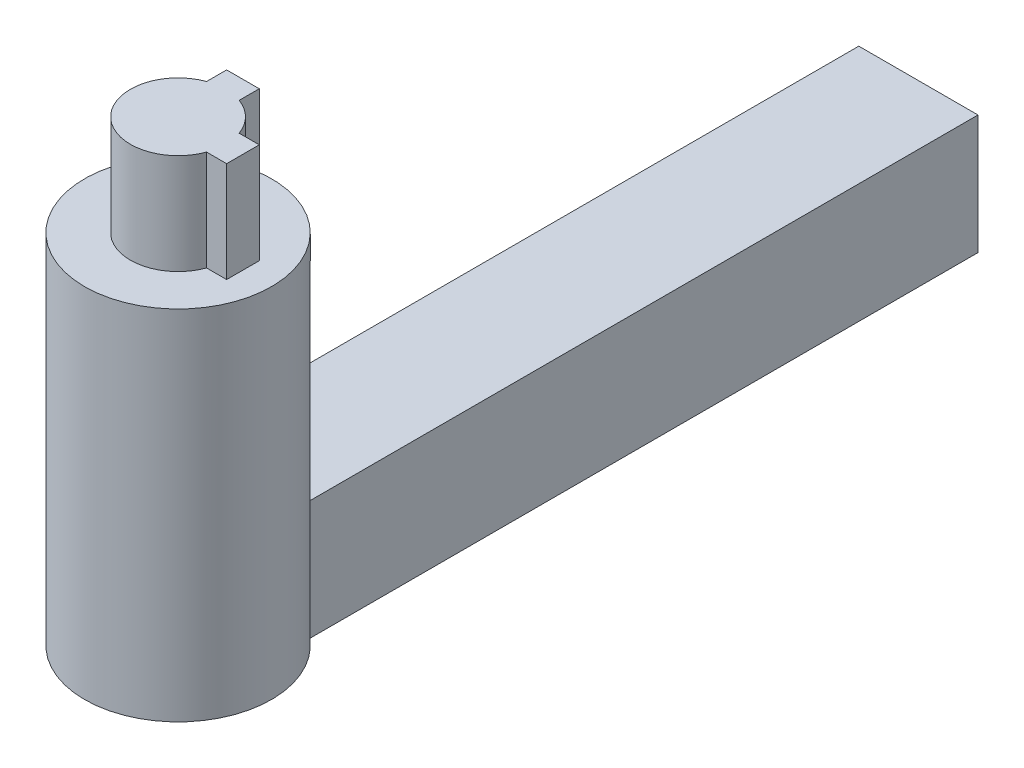
ISO-10303-21;
HEADER;
FILE_DESCRIPTION(('STEP AP214'),'2;1');
FILE_NAME('part.step','',(''),(''),'','','');
FILE_SCHEMA(('AUTOMOTIVE_DESIGN { 1 0 10303 214 1 1 1 1 }'));
ENDSEC;
DATA;
#1=APPLICATION_CONTEXT('core data for automotive mechanical design processes');
#2=APPLICATION_PROTOCOL_DEFINITION('international standard','automotive_design',2000,#1);
#3=PRODUCT_CONTEXT('',#1,'mechanical');
#4=PRODUCT('Part','Part','',(#3));
#5=PRODUCT_RELATED_PRODUCT_CATEGORY('part','',(#4));
#6=PRODUCT_DEFINITION_FORMATION('','',#4);
#7=PRODUCT_DEFINITION_CONTEXT('part definition',#1,'design');
#8=PRODUCT_DEFINITION('design','',#6,#7);
#9=PRODUCT_DEFINITION_SHAPE('','',#8);
#10=(LENGTH_UNIT() NAMED_UNIT(*) SI_UNIT(.MILLI.,.METRE.));
#11=(NAMED_UNIT(*) PLANE_ANGLE_UNIT() SI_UNIT($,.RADIAN.));
#12=(NAMED_UNIT(*) SI_UNIT($,.STERADIAN.) SOLID_ANGLE_UNIT());
#13=UNCERTAINTY_MEASURE_WITH_UNIT(LENGTH_MEASURE(1.E-05),#10,'distance_accuracy_value','');
#14=(GEOMETRIC_REPRESENTATION_CONTEXT(3) GLOBAL_UNCERTAINTY_ASSIGNED_CONTEXT((#13)) GLOBAL_UNIT_ASSIGNED_CONTEXT((#10,
#11,#12)) REPRESENTATION_CONTEXT('',''));
#15=CARTESIAN_POINT('',(0.,0.,0.));
#16=DIRECTION('',(0.,0.,1.));
#17=DIRECTION('',(1.,0.,0.));
#18=AXIS2_PLACEMENT_3D('',#15,#16,#17);
#19=CARTESIAN_POINT('',(4.75,9.5,-29.5));
#20=DIRECTION('',(-1.,0.,0.));
#21=DIRECTION('',(0.,0.,1.));
#22=AXIS2_PLACEMENT_3D('',#19,#20,#21);
#23=PLANE('',#22);
#24=DIRECTION('',(0.,0.,-1.));
#25=VECTOR('',#24,1.);
#26=CARTESIAN_POINT('',(4.75,9.5,-29.5));
#27=LINE('',#26,#25);
#28=CARTESIAN_POINT('',(4.75,9.5,23.7606620590873));
#29=VERTEX_POINT('',#28);
#30=CARTESIAN_POINT('',(4.75,9.5,-29.5));
#31=VERTEX_POINT('',#30);
#32=EDGE_CURVE('E181',#29,#31,#27,.T.);
#33=ORIENTED_EDGE('',*,*,#32,.F.);
#34=DIRECTION('',(0.,1.,0.));
#35=VECTOR('',#34,1.);
#36=CARTESIAN_POINT('',(4.75,-21.0717820793591,23.7606620590873));
#37=LINE('',#36,#35);
#38=CARTESIAN_POINT('',(4.75,0.,23.7606620590873));
#39=VERTEX_POINT('',#38);
#40=EDGE_CURVE('E177',#29,#39,#37,.F.);
#41=ORIENTED_EDGE('',*,*,#40,.T.);
#42=DIRECTION('',(0.,0.,-1.));
#43=VECTOR('',#42,1.);
#44=CARTESIAN_POINT('',(4.75,0.,-29.5));
#45=LINE('',#44,#43);
#46=CARTESIAN_POINT('',(4.75,0.,-29.5));
#47=VERTEX_POINT('',#46);
#48=EDGE_CURVE('E180',#39,#47,#45,.T.);
#49=ORIENTED_EDGE('',*,*,#48,.T.);
#50=DIRECTION('',(0.,-1.,0.));
#51=VECTOR('',#50,1.);
#52=CARTESIAN_POINT('',(4.75,9.5,-29.5));
#53=LINE('',#52,#51);
#54=EDGE_CURVE('E11',#31,#47,#53,.T.);
#55=ORIENTED_EDGE('',*,*,#54,.F.);
#56=EDGE_LOOP('',(#33,#41,#49,#55));
#57=FACE_BOUND('',#56,.T.);
#58=ADVANCED_FACE('F43',(#57),#23,.F.);
#59=CARTESIAN_POINT('',(-4.75,9.5,-29.5));
#60=DIRECTION('',(0.,0.,1.));
#61=DIRECTION('',(1.,0.,0.));
#62=AXIS2_PLACEMENT_3D('',#59,#60,#61);
#63=PLANE('',#62);
#64=DIRECTION('',(-1.,0.,0.));
#65=VECTOR('',#64,1.);
#66=CARTESIAN_POINT('',(-4.75,0.,-29.5));
#67=LINE('',#66,#65);
#68=CARTESIAN_POINT('',(-4.75,0.,-29.5));
#69=VERTEX_POINT('',#68);
#70=EDGE_CURVE('E193',#47,#69,#67,.T.);
#71=ORIENTED_EDGE('',*,*,#70,.T.);
#72=DIRECTION('',(0.,-1.,0.));
#73=VECTOR('',#72,1.);
#74=CARTESIAN_POINT('',(-4.75,9.5,-29.5));
#75=LINE('',#74,#73);
#76=CARTESIAN_POINT('',(-4.75,9.5,-29.5));
#77=VERTEX_POINT('',#76);
#78=EDGE_CURVE('E51',#77,#69,#75,.T.);
#79=ORIENTED_EDGE('',*,*,#78,.F.);
#80=DIRECTION('',(-1.,0.,0.));
#81=VECTOR('',#80,1.);
#82=CARTESIAN_POINT('',(-4.75,9.5,-29.5));
#83=LINE('',#82,#81);
#84=EDGE_CURVE('E184',#31,#77,#83,.T.);
#85=ORIENTED_EDGE('',*,*,#84,.F.);
#86=ORIENTED_EDGE('',*,*,#54,.T.);
#87=EDGE_LOOP('',(#71,#79,#85,#86));
#88=FACE_BOUND('',#87,.T.);
#89=ADVANCED_FACE('F220',(#88),#63,.F.);
#90=CARTESIAN_POINT('',(-4.75,9.5,-29.5));
#91=DIRECTION('',(1.,0.,0.));
#92=DIRECTION('',(0.,0.,-1.));
#93=AXIS2_PLACEMENT_3D('',#90,#91,#92);
#94=PLANE('',#93);
#95=DIRECTION('',(0.,0.,1.));
#96=VECTOR('',#95,1.);
#97=CARTESIAN_POINT('',(-4.75,0.,-29.5));
#98=LINE('',#97,#96);
#99=CARTESIAN_POINT('',(-4.75,0.,23.7606620590873));
#100=VERTEX_POINT('',#99);
#101=EDGE_CURVE('E185',#69,#100,#98,.T.);
#102=ORIENTED_EDGE('',*,*,#101,.T.);
#103=DIRECTION('',(0.,1.,0.));
#104=VECTOR('',#103,1.);
#105=CARTESIAN_POINT('',(-4.75,-21.0717820793591,23.7606620590873));
#106=LINE('',#105,#104);
#107=CARTESIAN_POINT('',(-4.75,9.5,23.7606620590873));
#108=VERTEX_POINT('',#107);
#109=EDGE_CURVE('E173',#100,#108,#106,.T.);
#110=ORIENTED_EDGE('',*,*,#109,.T.);
#111=DIRECTION('',(0.,0.,1.));
#112=VECTOR('',#111,1.);
#113=CARTESIAN_POINT('',(-4.75,9.5,-29.5));
#114=LINE('',#113,#112);
#115=EDGE_CURVE('E188',#77,#108,#114,.T.);
#116=ORIENTED_EDGE('',*,*,#115,.F.);
#117=ORIENTED_EDGE('',*,*,#78,.T.);
#118=EDGE_LOOP('',(#102,#110,#116,#117));
#119=FACE_BOUND('',#118,.T.);
#120=ADVANCED_FACE('F203',(#119),#94,.F.);
#121=CARTESIAN_POINT('',(0.,9.5,0.));
#122=DIRECTION('',(0.,1.,0.));
#123=DIRECTION('',(0.,0.,1.));
#124=AXIS2_PLACEMENT_3D('',#121,#122,#123);
#125=PLANE('',#124);
#126=CARTESIAN_POINT('',(0.,9.5,29.5));
#127=DIRECTION('',(0.,1.,0.));
#128=DIRECTION('',(0.,0.,1.));
#129=AXIS2_PLACEMENT_3D('',#126,#127,#128);
#130=CIRCLE('',#129,7.45);
#131=EDGE_CURVE('E169',#29,#108,#130,.T.);
#132=ORIENTED_EDGE('',*,*,#131,.F.);
#133=ORIENTED_EDGE('',*,*,#32,.T.);
#134=ORIENTED_EDGE('',*,*,#84,.T.);
#135=ORIENTED_EDGE('',*,*,#115,.T.);
#136=EDGE_LOOP('',(#132,#133,#134,#135));
#137=FACE_BOUND('',#136,.T.);
#138=ADVANCED_FACE('F217',(#137),#125,.T.);
#139=CARTESIAN_POINT('',(0.,0.,0.));
#140=DIRECTION('',(0.,1.,0.));
#141=DIRECTION('',(0.,0.,1.));
#142=AXIS2_PLACEMENT_3D('',#139,#140,#141);
#143=PLANE('',#142);
#144=ORIENTED_EDGE('',*,*,#48,.F.);
#145=CARTESIAN_POINT('',(0.,0.,29.5));
#146=DIRECTION('',(0.,1.,0.));
#147=DIRECTION('',(0.,0.,1.));
#148=AXIS2_PLACEMENT_3D('',#145,#146,#147);
#149=CIRCLE('',#148,7.45);
#150=EDGE_CURVE('E160',#39,#100,#149,.F.);
#151=ORIENTED_EDGE('',*,*,#150,.T.);
#152=ORIENTED_EDGE('',*,*,#101,.F.);
#153=ORIENTED_EDGE('',*,*,#70,.F.);
#154=EDGE_LOOP('',(#144,#151,#152,#153));
#155=FACE_BOUND('',#154,.T.);
#156=ADVANCED_FACE('F210',(#155),#143,.F.);
#157=CARTESIAN_POINT('',(0.,-21.0717820793591,29.5));
#158=DIRECTION('',(0.,1.,0.));
#159=DIRECTION('',(0.,0.,1.));
#160=AXIS2_PLACEMENT_3D('',#157,#158,#159);
#161=CYLINDRICAL_SURFACE('',#160,7.45);
#162=CARTESIAN_POINT('',(0.,28.5,29.5));
#163=DIRECTION('',(0.,1.,0.));
#164=DIRECTION('',(0.,0.,1.));
#165=AXIS2_PLACEMENT_3D('',#162,#163,#164);
#166=CIRCLE('',#165,7.45);
#167=CARTESIAN_POINT('',(0.,28.5,36.95));
#168=VERTEX_POINT('',#167);
#169=EDGE_CURVE('E155',#168,#168,#166,.T.);
#170=ORIENTED_EDGE('',*,*,#169,.F.);
#171=EDGE_LOOP('',(#170));
#172=FACE_BOUND('',#171,.T.);
#173=ORIENTED_EDGE('',*,*,#40,.F.);
#174=ORIENTED_EDGE('',*,*,#131,.T.);
#175=ORIENTED_EDGE('',*,*,#109,.F.);
#176=ORIENTED_EDGE('',*,*,#150,.F.);
#177=EDGE_LOOP('',(#173,#174,#175,#176));
#178=FACE_BOUND('',#177,.T.);
#179=ADVANCED_FACE('F214',(#172,#178),#161,.T.);
#180=CARTESIAN_POINT('',(0.,28.5,29.5));
#181=DIRECTION('',(0.,1.,0.));
#182=DIRECTION('',(0.,0.,1.));
#183=AXIS2_PLACEMENT_3D('',#180,#181,#182);
#184=PLANE('',#183);
#185=CARTESIAN_POINT('',(0.,28.5,29.5));
#186=DIRECTION('',(0.,1.,0.));
#187=DIRECTION('',(0.,0.,1.));
#188=AXIS2_PLACEMENT_3D('',#185,#186,#187);
#189=CIRCLE('',#188,3.8);
#190=CARTESIAN_POINT('',(-1.3,28.5,25.9292857857286));
#191=VERTEX_POINT('',#190);
#192=CARTESIAN_POINT('',(3.57071421427142,28.5,30.8));
#193=VERTEX_POINT('',#192);
#194=EDGE_CURVE('E58',#191,#193,#189,.T.);
#195=ORIENTED_EDGE('',*,*,#194,.F.);
#196=DIRECTION('',(0.,0.,1.));
#197=VECTOR('',#196,1.);
#198=CARTESIAN_POINT('',(-1.3,28.5,25.9292857857286));
#199=LINE('',#198,#197);
#200=CARTESIAN_POINT('',(-1.3,28.5,24.3292857857286));
#201=VERTEX_POINT('',#200);
#202=EDGE_CURVE('E62',#201,#191,#199,.T.);
#203=ORIENTED_EDGE('',*,*,#202,.F.);
#204=DIRECTION('',(-1.,0.,0.));
#205=VECTOR('',#204,1.);
#206=CARTESIAN_POINT('',(-1.3,28.5,24.3292857857286));
#207=LINE('',#206,#205);
#208=CARTESIAN_POINT('',(1.3,28.5,24.3292857857286));
#209=VERTEX_POINT('',#208);
#210=EDGE_CURVE('E371',#209,#201,#207,.T.);
#211=ORIENTED_EDGE('',*,*,#210,.F.);
#212=DIRECTION('',(0.,0.,-1.));
#213=VECTOR('',#212,1.);
#214=CARTESIAN_POINT('',(1.3,28.5,25.9292857857286));
#215=LINE('',#214,#213);
#216=CARTESIAN_POINT('',(1.3,28.5,25.9292857857286));
#217=VERTEX_POINT('',#216);
#218=EDGE_CURVE('E416',#217,#209,#215,.T.);
#219=ORIENTED_EDGE('',*,*,#218,.F.);
#220=CARTESIAN_POINT('',(0.,28.5,29.5));
#221=DIRECTION('',(0.,1.,0.));
#222=DIRECTION('',(0.,0.,1.));
#223=AXIS2_PLACEMENT_3D('',#220,#221,#222);
#224=CIRCLE('',#223,3.8);
#225=CARTESIAN_POINT('',(3.57071421427143,28.5,28.2));
#226=VERTEX_POINT('',#225);
#227=EDGE_CURVE('E408',#226,#217,#224,.T.);
#228=ORIENTED_EDGE('',*,*,#227,.F.);
#229=DIRECTION('',(-1.,0.,0.));
#230=VECTOR('',#229,1.);
#231=CARTESIAN_POINT('',(3.57071421427143,28.5,28.2));
#232=LINE('',#231,#230);
#233=CARTESIAN_POINT('',(5.17071421427143,28.5,28.2));
#234=VERTEX_POINT('',#233);
#235=EDGE_CURVE('E399',#234,#226,#232,.T.);
#236=ORIENTED_EDGE('',*,*,#235,.F.);
#237=DIRECTION('',(0.,0.,-1.));
#238=VECTOR('',#237,1.);
#239=CARTESIAN_POINT('',(5.17071421427143,28.5,28.2));
#240=LINE('',#239,#238);
#241=CARTESIAN_POINT('',(5.17071421427142,28.5,30.8));
#242=VERTEX_POINT('',#241);
#243=EDGE_CURVE('E402',#242,#234,#240,.T.);
#244=ORIENTED_EDGE('',*,*,#243,.F.);
#245=DIRECTION('',(1.,0.,0.));
#246=VECTOR('',#245,1.);
#247=CARTESIAN_POINT('',(3.57071421427142,28.5,30.8));
#248=LINE('',#247,#246);
#249=EDGE_CURVE('E404',#193,#242,#248,.T.);
#250=ORIENTED_EDGE('',*,*,#249,.F.);
#251=EDGE_LOOP('',(#195,#203,#211,#219,#228,#236,#244,#250));
#252=FACE_BOUND('',#251,.T.);
#253=ORIENTED_EDGE('',*,*,#169,.T.);
#254=EDGE_LOOP('',(#253));
#255=FACE_BOUND('',#254,.T.);
#256=ADVANCED_FACE('F234',(#252,#255),#184,.T.);
#257=CARTESIAN_POINT('',(0.,36.5,29.5));
#258=DIRECTION('',(0.,-1.,0.));
#259=DIRECTION('',(0.,0.,-1.));
#260=AXIS2_PLACEMENT_3D('',#257,#258,#259);
#261=CYLINDRICAL_SURFACE('',#260,3.8);
#262=ORIENTED_EDGE('',*,*,#194,.T.);
#263=DIRECTION('',(0.,-1.,0.));
#264=VECTOR('',#263,1.);
#265=CARTESIAN_POINT('',(3.57071421427142,36.5,30.8));
#266=LINE('',#265,#264);
#267=CARTESIAN_POINT('',(3.57071421427142,36.5,30.8));
#268=VERTEX_POINT('',#267);
#269=EDGE_CURVE('E135',#268,#193,#266,.T.);
#270=ORIENTED_EDGE('',*,*,#269,.F.);
#271=CARTESIAN_POINT('',(0.,36.5,29.5));
#272=DIRECTION('',(0.,1.,0.));
#273=DIRECTION('',(0.,0.,1.));
#274=AXIS2_PLACEMENT_3D('',#271,#272,#273);
#275=CIRCLE('',#274,3.8);
#276=CARTESIAN_POINT('',(-1.3,36.5,25.9292857857286));
#277=VERTEX_POINT('',#276);
#278=EDGE_CURVE('E142',#277,#268,#275,.T.);
#279=ORIENTED_EDGE('',*,*,#278,.F.);
#280=DIRECTION('',(0.,-1.,0.));
#281=VECTOR('',#280,1.);
#282=CARTESIAN_POINT('',(-1.3,36.5,25.9292857857286));
#283=LINE('',#282,#281);
#284=EDGE_CURVE('E367',#277,#191,#283,.T.);
#285=ORIENTED_EDGE('',*,*,#284,.T.);
#286=EDGE_LOOP('',(#262,#270,#279,#285));
#287=FACE_BOUND('',#286,.T.);
#288=ADVANCED_FACE('F153',(#287),#261,.T.);
#289=CARTESIAN_POINT('',(3.57071421427142,36.5,30.8));
#290=DIRECTION('',(0.,0.,-1.));
#291=DIRECTION('',(-1.,0.,0.));
#292=AXIS2_PLACEMENT_3D('',#289,#290,#291);
#293=PLANE('',#292);
#294=ORIENTED_EDGE('',*,*,#249,.T.);
#295=DIRECTION('',(0.,-1.,0.));
#296=VECTOR('',#295,1.);
#297=CARTESIAN_POINT('',(5.17071421427142,36.5,30.8));
#298=LINE('',#297,#296);
#299=CARTESIAN_POINT('',(5.17071421427142,36.5,30.8));
#300=VERTEX_POINT('',#299);
#301=EDGE_CURVE('E137',#300,#242,#298,.T.);
#302=ORIENTED_EDGE('',*,*,#301,.F.);
#303=DIRECTION('',(1.,0.,0.));
#304=VECTOR('',#303,1.);
#305=CARTESIAN_POINT('',(3.57071421427142,36.5,30.8));
#306=LINE('',#305,#304);
#307=EDGE_CURVE('E130',#268,#300,#306,.T.);
#308=ORIENTED_EDGE('',*,*,#307,.F.);
#309=ORIENTED_EDGE('',*,*,#269,.T.);
#310=EDGE_LOOP('',(#294,#302,#308,#309));
#311=FACE_BOUND('',#310,.T.);
#312=ADVANCED_FACE('F133',(#311),#293,.F.);
#313=CARTESIAN_POINT('',(5.17071421427143,36.5,28.2));
#314=DIRECTION('',(-1.,0.,0.));
#315=DIRECTION('',(0.,0.,1.));
#316=AXIS2_PLACEMENT_3D('',#313,#314,#315);
#317=PLANE('',#316);
#318=ORIENTED_EDGE('',*,*,#243,.T.);
#319=DIRECTION('',(0.,-1.,0.));
#320=VECTOR('',#319,1.);
#321=CARTESIAN_POINT('',(5.17071421427143,36.5,28.2));
#322=LINE('',#321,#320);
#323=CARTESIAN_POINT('',(5.17071421427143,36.5,28.2));
#324=VERTEX_POINT('',#323);
#325=EDGE_CURVE('E162',#324,#234,#322,.T.);
#326=ORIENTED_EDGE('',*,*,#325,.F.);
#327=DIRECTION('',(0.,0.,-1.));
#328=VECTOR('',#327,1.);
#329=CARTESIAN_POINT('',(5.17071421427143,36.5,28.2));
#330=LINE('',#329,#328);
#331=EDGE_CURVE('E141',#300,#324,#330,.T.);
#332=ORIENTED_EDGE('',*,*,#331,.F.);
#333=ORIENTED_EDGE('',*,*,#301,.T.);
#334=EDGE_LOOP('',(#318,#326,#332,#333));
#335=FACE_BOUND('',#334,.T.);
#336=ADVANCED_FACE('F242',(#335),#317,.F.);
#337=CARTESIAN_POINT('',(3.57071421427143,36.5,28.2));
#338=DIRECTION('',(0.,0.,1.));
#339=DIRECTION('',(1.,0.,0.));
#340=AXIS2_PLACEMENT_3D('',#337,#338,#339);
#341=PLANE('',#340);
#342=ORIENTED_EDGE('',*,*,#235,.T.);
#343=DIRECTION('',(0.,-1.,0.));
#344=VECTOR('',#343,1.);
#345=CARTESIAN_POINT('',(3.57071421427143,36.5,28.2));
#346=LINE('',#345,#344);
#347=CARTESIAN_POINT('',(3.57071421427143,36.5,28.2));
#348=VERTEX_POINT('',#347);
#349=EDGE_CURVE('E390',#348,#226,#346,.T.);
#350=ORIENTED_EDGE('',*,*,#349,.F.);
#351=DIRECTION('',(-1.,0.,0.));
#352=VECTOR('',#351,1.);
#353=CARTESIAN_POINT('',(3.57071421427143,36.5,28.2));
#354=LINE('',#353,#352);
#355=EDGE_CURVE('E400',#324,#348,#354,.T.);
#356=ORIENTED_EDGE('',*,*,#355,.F.);
#357=ORIENTED_EDGE('',*,*,#325,.T.);
#358=EDGE_LOOP('',(#342,#350,#356,#357));
#359=FACE_BOUND('',#358,.T.);
#360=ADVANCED_FACE('F245',(#359),#341,.F.);
#361=CARTESIAN_POINT('',(0.,36.5,29.5));
#362=DIRECTION('',(0.,-1.,0.));
#363=DIRECTION('',(0.,0.,-1.));
#364=AXIS2_PLACEMENT_3D('',#361,#362,#363);
#365=CYLINDRICAL_SURFACE('',#364,3.8);
#366=ORIENTED_EDGE('',*,*,#227,.T.);
#367=DIRECTION('',(0.,-1.,0.));
#368=VECTOR('',#367,1.);
#369=CARTESIAN_POINT('',(1.3,36.5,25.9292857857286));
#370=LINE('',#369,#368);
#371=CARTESIAN_POINT('',(1.3,36.5,25.9292857857286));
#372=VERTEX_POINT('',#371);
#373=EDGE_CURVE('E386',#372,#217,#370,.T.);
#374=ORIENTED_EDGE('',*,*,#373,.F.);
#375=CARTESIAN_POINT('',(0.,36.5,29.5));
#376=DIRECTION('',(0.,1.,0.));
#377=DIRECTION('',(0.,0.,1.));
#378=AXIS2_PLACEMENT_3D('',#375,#376,#377);
#379=CIRCLE('',#378,3.8);
#380=EDGE_CURVE('E427',#348,#372,#379,.T.);
#381=ORIENTED_EDGE('',*,*,#380,.F.);
#382=ORIENTED_EDGE('',*,*,#349,.T.);
#383=EDGE_LOOP('',(#366,#374,#381,#382));
#384=FACE_BOUND('',#383,.T.);
#385=ADVANCED_FACE('F249',(#384),#365,.T.);
#386=CARTESIAN_POINT('',(1.3,36.5,25.9292857857286));
#387=DIRECTION('',(-1.,0.,0.));
#388=DIRECTION('',(0.,0.,1.));
#389=AXIS2_PLACEMENT_3D('',#386,#387,#388);
#390=PLANE('',#389);
#391=ORIENTED_EDGE('',*,*,#218,.T.);
#392=DIRECTION('',(0.,-1.,0.));
#393=VECTOR('',#392,1.);
#394=CARTESIAN_POINT('',(1.3,36.5,24.3292857857286));
#395=LINE('',#394,#393);
#396=CARTESIAN_POINT('',(1.3,36.5,24.3292857857286));
#397=VERTEX_POINT('',#396);
#398=EDGE_CURVE('E377',#397,#209,#395,.T.);
#399=ORIENTED_EDGE('',*,*,#398,.F.);
#400=DIRECTION('',(0.,0.,-1.));
#401=VECTOR('',#400,1.);
#402=CARTESIAN_POINT('',(1.3,36.5,25.9292857857286));
#403=LINE('',#402,#401);
#404=EDGE_CURVE('E425',#372,#397,#403,.T.);
#405=ORIENTED_EDGE('',*,*,#404,.F.);
#406=ORIENTED_EDGE('',*,*,#373,.T.);
#407=EDGE_LOOP('',(#391,#399,#405,#406));
#408=FACE_BOUND('',#407,.T.);
#409=ADVANCED_FACE('F253',(#408),#390,.F.);
#410=CARTESIAN_POINT('',(-1.3,36.5,24.3292857857286));
#411=DIRECTION('',(0.,0.,1.));
#412=DIRECTION('',(1.,0.,0.));
#413=AXIS2_PLACEMENT_3D('',#410,#411,#412);
#414=PLANE('',#413);
#415=ORIENTED_EDGE('',*,*,#210,.T.);
#416=DIRECTION('',(0.,-1.,0.));
#417=VECTOR('',#416,1.);
#418=CARTESIAN_POINT('',(-1.3,36.5,24.3292857857286));
#419=LINE('',#418,#417);
#420=CARTESIAN_POINT('',(-1.3,36.5,24.3292857857286));
#421=VERTEX_POINT('',#420);
#422=EDGE_CURVE('E369',#421,#201,#419,.T.);
#423=ORIENTED_EDGE('',*,*,#422,.F.);
#424=DIRECTION('',(-1.,0.,0.));
#425=VECTOR('',#424,1.);
#426=CARTESIAN_POINT('',(-1.3,36.5,24.3292857857286));
#427=LINE('',#426,#425);
#428=EDGE_CURVE('E379',#397,#421,#427,.T.);
#429=ORIENTED_EDGE('',*,*,#428,.F.);
#430=ORIENTED_EDGE('',*,*,#398,.T.);
#431=EDGE_LOOP('',(#415,#423,#429,#430));
#432=FACE_BOUND('',#431,.T.);
#433=ADVANCED_FACE('F257',(#432),#414,.F.);
#434=CARTESIAN_POINT('',(-1.3,36.5,25.9292857857286));
#435=DIRECTION('',(1.,0.,0.));
#436=DIRECTION('',(0.,0.,-1.));
#437=AXIS2_PLACEMENT_3D('',#434,#435,#436);
#438=PLANE('',#437);
#439=ORIENTED_EDGE('',*,*,#202,.T.);
#440=ORIENTED_EDGE('',*,*,#284,.F.);
#441=DIRECTION('',(0.,0.,1.));
#442=VECTOR('',#441,1.);
#443=CARTESIAN_POINT('',(-1.3,36.5,25.9292857857286));
#444=LINE('',#443,#442);
#445=EDGE_CURVE('E147',#421,#277,#444,.T.);
#446=ORIENTED_EDGE('',*,*,#445,.F.);
#447=ORIENTED_EDGE('',*,*,#422,.T.);
#448=EDGE_LOOP('',(#439,#440,#446,#447));
#449=FACE_BOUND('',#448,.T.);
#450=ADVANCED_FACE('F261',(#449),#438,.F.);
#451=CARTESIAN_POINT('',(0.,36.5,29.5));
#452=DIRECTION('',(0.,1.,0.));
#453=DIRECTION('',(0.,0.,1.));
#454=AXIS2_PLACEMENT_3D('',#451,#452,#453);
#455=PLANE('',#454);
#456=ORIENTED_EDGE('',*,*,#278,.T.);
#457=ORIENTED_EDGE('',*,*,#307,.T.);
#458=ORIENTED_EDGE('',*,*,#331,.T.);
#459=ORIENTED_EDGE('',*,*,#355,.T.);
#460=ORIENTED_EDGE('',*,*,#380,.T.);
#461=ORIENTED_EDGE('',*,*,#404,.T.);
#462=ORIENTED_EDGE('',*,*,#428,.T.);
#463=ORIENTED_EDGE('',*,*,#445,.T.);
#464=EDGE_LOOP('',(#456,#457,#458,#459,#460,#461,#462,#463));
#465=FACE_BOUND('',#464,.T.);
#466=ADVANCED_FACE('F145',(#465),#455,.T.);
#467=CLOSED_SHELL('',(#58,#89,#120,#138,#156,#179,#256,#288,#312,#336,#360,#385,#409,#433,#450,#466));
#468=MANIFOLD_SOLID_BREP('B2',#467);
#469=ADVANCED_BREP_SHAPE_REPRESENTATION('',(#18,#468),#14);
#470=SHAPE_DEFINITION_REPRESENTATION(#9,#469);
ENDSEC;
END-ISO-10303-21;
